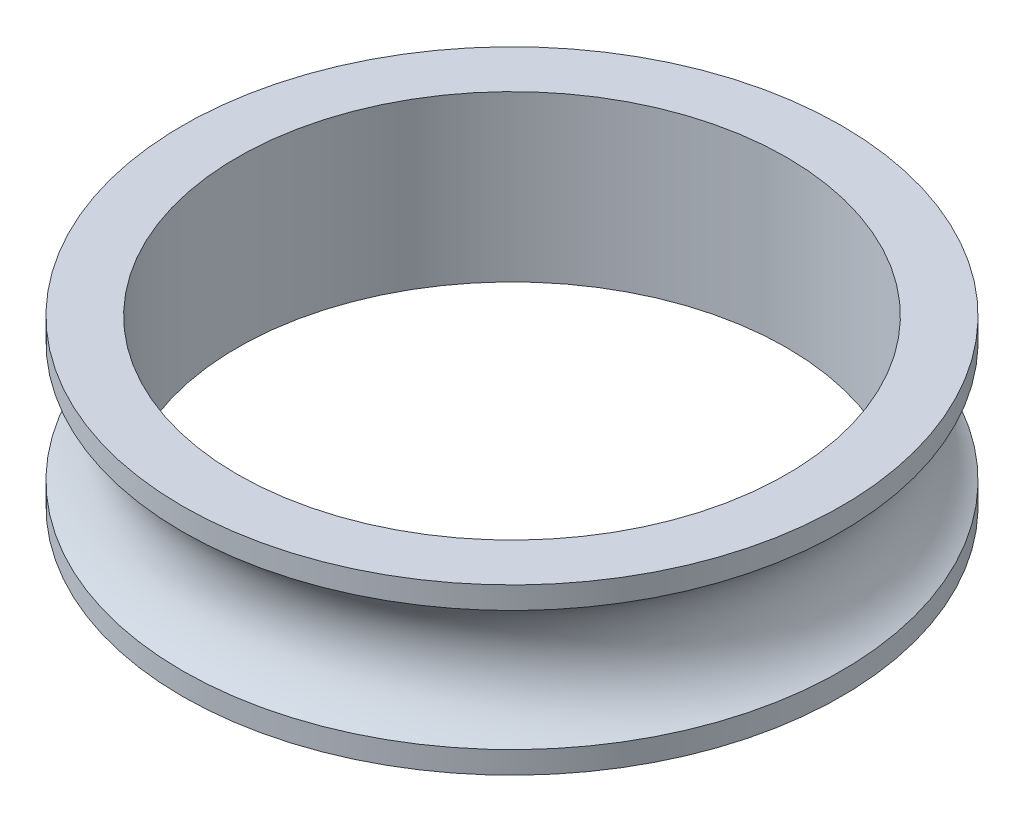
ISO-10303-21;
HEADER;
FILE_DESCRIPTION(('STEP AP214'),'2;1');
FILE_NAME('part.step','',(''),(''),'','','');
FILE_SCHEMA(('AUTOMOTIVE_DESIGN { 1 0 10303 214 1 1 1 1 }'));
ENDSEC;
DATA;
#1=APPLICATION_CONTEXT('core data for automotive mechanical design processes');
#2=APPLICATION_PROTOCOL_DEFINITION('international standard','automotive_design',2000,#1);
#3=PRODUCT_CONTEXT('',#1,'mechanical');
#4=PRODUCT('Part','Part','',(#3));
#5=PRODUCT_RELATED_PRODUCT_CATEGORY('part','',(#4));
#6=PRODUCT_DEFINITION_FORMATION('','',#4);
#7=PRODUCT_DEFINITION_CONTEXT('part definition',#1,'design');
#8=PRODUCT_DEFINITION('design','',#6,#7);
#9=PRODUCT_DEFINITION_SHAPE('','',#8);
#10=(LENGTH_UNIT() NAMED_UNIT(*) SI_UNIT(.MILLI.,.METRE.));
#11=(NAMED_UNIT(*) PLANE_ANGLE_UNIT() SI_UNIT($,.RADIAN.));
#12=(NAMED_UNIT(*) SI_UNIT($,.STERADIAN.) SOLID_ANGLE_UNIT());
#13=UNCERTAINTY_MEASURE_WITH_UNIT(LENGTH_MEASURE(1.E-05),#10,'distance_accuracy_value','');
#14=(GEOMETRIC_REPRESENTATION_CONTEXT(3) GLOBAL_UNCERTAINTY_ASSIGNED_CONTEXT((#13)) GLOBAL_UNIT_ASSIGNED_CONTEXT((#10,
#11,#12)) REPRESENTATION_CONTEXT('',''));
#15=CARTESIAN_POINT('',(0.,0.,0.));
#16=DIRECTION('',(0.,0.,1.));
#17=DIRECTION('',(1.,0.,0.));
#18=AXIS2_PLACEMENT_3D('',#15,#16,#17);
#19=CARTESIAN_POINT('',(0.,6.,0.));
#20=DIRECTION('',(0.,-1.,0.));
#21=DIRECTION('',(0.,0.,-1.));
#22=AXIS2_PLACEMENT_3D('',#19,#20,#21);
#23=CYLINDRICAL_SURFACE('',#22,12.);
#24=CARTESIAN_POINT('',(0.,0.,0.));
#25=DIRECTION('',(0.,1.,0.));
#26=DIRECTION('',(0.,0.,1.));
#27=AXIS2_PLACEMENT_3D('',#24,#25,#26);
#28=CIRCLE('',#27,12.);
#29=CARTESIAN_POINT('',(0.,0.,12.));
#30=VERTEX_POINT('',#29);
#31=EDGE_CURVE('E49',#30,#30,#28,.T.);
#32=ORIENTED_EDGE('',*,*,#31,.T.);
#33=EDGE_LOOP('',(#32));
#34=FACE_BOUND('',#33,.T.);
#35=CARTESIAN_POINT('',(0.,0.806828780053867,0.));
#36=DIRECTION('',(0.,1.,0.));
#37=DIRECTION('',(0.,0.,1.));
#38=AXIS2_PLACEMENT_3D('',#35,#36,#37);
#39=CIRCLE('',#38,12.);
#40=CARTESIAN_POINT('',(0.,0.806828780053867,12.));
#41=VERTEX_POINT('',#40);
#42=EDGE_CURVE('E46',#41,#41,#39,.T.);
#43=ORIENTED_EDGE('',*,*,#42,.F.);
#44=EDGE_LOOP('',(#43));
#45=FACE_BOUND('',#44,.T.);
#46=ADVANCED_FACE('F43',(#34,#45),#23,.T.);
#47=CARTESIAN_POINT('',(0.,6.,0.));
#48=DIRECTION('',(0.,1.,0.));
#49=DIRECTION('',(0.,0.,1.));
#50=AXIS2_PLACEMENT_3D('',#47,#48,#49);
#51=CIRCLE('',#50,12.);
#52=CARTESIAN_POINT('',(0.,6.,12.));
#53=VERTEX_POINT('',#52);
#54=EDGE_CURVE('E11',#53,#53,#51,.T.);
#55=ORIENTED_EDGE('',*,*,#54,.F.);
#56=EDGE_LOOP('',(#55));
#57=FACE_BOUND('',#56,.T.);
#58=CARTESIAN_POINT('',(0.,5.19317121994613,0.));
#59=DIRECTION('',(0.,-1.,0.));
#60=DIRECTION('',(0.,0.,-1.));
#61=AXIS2_PLACEMENT_3D('',#58,#59,#60);
#62=CIRCLE('',#61,12.);
#63=CARTESIAN_POINT('',(0.,5.19317121994613,-12.));
#64=VERTEX_POINT('',#63);
#65=EDGE_CURVE('E58',#64,#64,#62,.T.);
#66=ORIENTED_EDGE('',*,*,#65,.F.);
#67=EDGE_LOOP('',(#66));
#68=FACE_BOUND('',#67,.T.);
#69=ADVANCED_FACE('F76',(#57,#68),#23,.T.);
#70=CARTESIAN_POINT('',(0.,6.,0.));
#71=DIRECTION('',(0.,1.,0.));
#72=DIRECTION('',(0.,0.,1.));
#73=AXIS2_PLACEMENT_3D('',#70,#71,#72);
#74=PLANE('',#73);
#75=ORIENTED_EDGE('',*,*,#54,.T.);
#76=EDGE_LOOP('',(#75));
#77=FACE_BOUND('',#76,.T.);
#78=CARTESIAN_POINT('',(0.,6.,0.));
#79=DIRECTION('',(0.,1.,0.));
#80=DIRECTION('',(0.,0.,1.));
#81=AXIS2_PLACEMENT_3D('',#78,#79,#80);
#82=CIRCLE('',#81,10.);
#83=CARTESIAN_POINT('',(0.,6.,10.));
#84=VERTEX_POINT('',#83);
#85=EDGE_CURVE('E54',#84,#84,#82,.T.);
#86=ORIENTED_EDGE('',*,*,#85,.F.);
#87=EDGE_LOOP('',(#86));
#88=FACE_BOUND('',#87,.T.);
#89=ADVANCED_FACE('F77',(#77,#88),#74,.T.);
#90=CARTESIAN_POINT('',(0.,0.,0.));
#91=DIRECTION('',(0.,1.,0.));
#92=DIRECTION('',(0.,0.,1.));
#93=AXIS2_PLACEMENT_3D('',#90,#91,#92);
#94=PLANE('',#93);
#95=ORIENTED_EDGE('',*,*,#31,.F.);
#96=EDGE_LOOP('',(#95));
#97=FACE_BOUND('',#96,.T.);
#98=CARTESIAN_POINT('',(0.,0.,0.));
#99=DIRECTION('',(0.,1.,0.));
#100=DIRECTION('',(0.,0.,1.));
#101=AXIS2_PLACEMENT_3D('',#98,#99,#100);
#102=CIRCLE('',#101,10.);
#103=CARTESIAN_POINT('',(0.,0.,10.));
#104=VERTEX_POINT('',#103);
#105=EDGE_CURVE('E59',#104,#104,#102,.T.);
#106=ORIENTED_EDGE('',*,*,#105,.T.);
#107=EDGE_LOOP('',(#106));
#108=FACE_BOUND('',#107,.T.);
#109=ADVANCED_FACE('F80',(#97,#108),#94,.F.);
#110=CARTESIAN_POINT('',(0.,6.,0.));
#111=DIRECTION('',(0.,-1.,0.));
#112=DIRECTION('',(0.,0.,-1.));
#113=AXIS2_PLACEMENT_3D('',#110,#111,#112);
#114=CYLINDRICAL_SURFACE('',#113,10.);
#115=ORIENTED_EDGE('',*,*,#85,.T.);
#116=EDGE_LOOP('',(#115));
#117=FACE_BOUND('',#116,.T.);
#118=ORIENTED_EDGE('',*,*,#105,.F.);
#119=EDGE_LOOP('',(#118));
#120=FACE_BOUND('',#119,.T.);
#121=ADVANCED_FACE('F71',(#117,#120),#114,.F.);
#122=CARTESIAN_POINT('',(0.,3.,0.));
#123=DIRECTION('',(0.,-1.,0.));
#124=DIRECTION('',(0.,0.,-1.));
#125=AXIS2_PLACEMENT_3D('',#122,#123,#124);
#126=TOROIDAL_SURFACE('',#125,13.2,2.5);
#127=ORIENTED_EDGE('',*,*,#65,.T.);
#128=EDGE_LOOP('',(#127));
#129=FACE_BOUND('',#128,.T.);
#130=ORIENTED_EDGE('',*,*,#42,.T.);
#131=EDGE_LOOP('',(#130));
#132=FACE_BOUND('',#131,.T.);
#133=ADVANCED_FACE('F106',(#129,#132),#126,.F.);
#134=CLOSED_SHELL('',(#46,#69,#89,#109,#121,#133));
#135=MANIFOLD_SOLID_BREP('B2',#134);
#136=ADVANCED_BREP_SHAPE_REPRESENTATION('',(#18,#135),#14);
#137=SHAPE_DEFINITION_REPRESENTATION(#9,#136);
ENDSEC;
END-ISO-10303-21;
